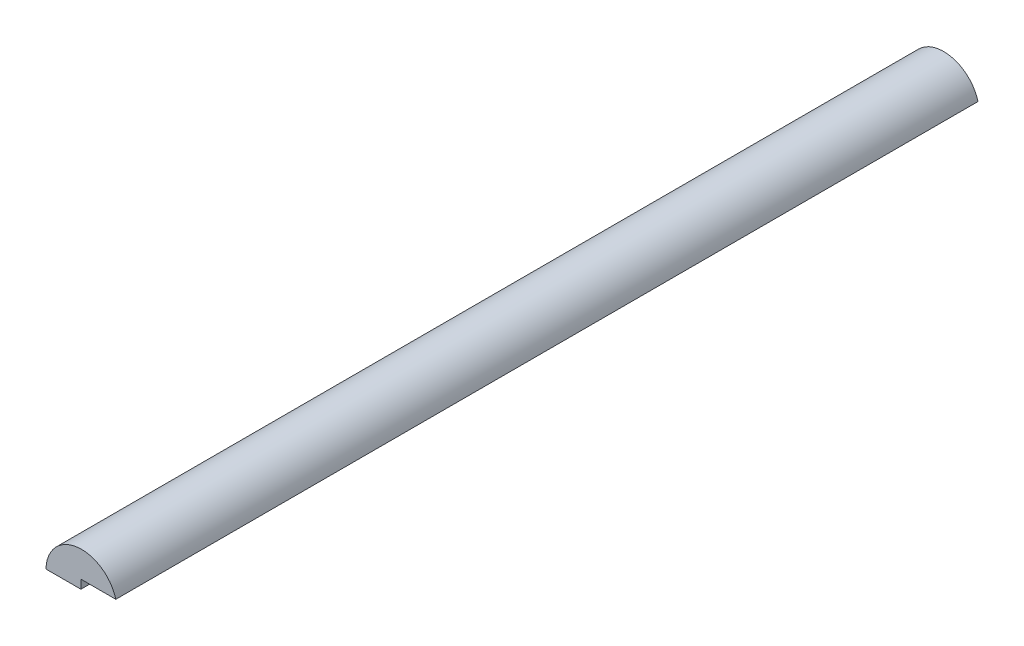
ISO-10303-21;
HEADER;
FILE_DESCRIPTION(('STEP AP214'),'2;1');
FILE_NAME('part.step','',(''),(''),'','','');
FILE_SCHEMA(('AUTOMOTIVE_DESIGN { 1 0 10303 214 1 1 1 1 }'));
ENDSEC;
DATA;
#1=APPLICATION_CONTEXT('core data for automotive mechanical design processes');
#2=APPLICATION_PROTOCOL_DEFINITION('international standard','automotive_design',2000,#1);
#3=PRODUCT_CONTEXT('',#1,'mechanical');
#4=PRODUCT('Part','Part','',(#3));
#5=PRODUCT_RELATED_PRODUCT_CATEGORY('part','',(#4));
#6=PRODUCT_DEFINITION_FORMATION('','',#4);
#7=PRODUCT_DEFINITION_CONTEXT('part definition',#1,'design');
#8=PRODUCT_DEFINITION('design','',#6,#7);
#9=PRODUCT_DEFINITION_SHAPE('','',#8);
#10=(LENGTH_UNIT() NAMED_UNIT(*) SI_UNIT(.MILLI.,.METRE.));
#11=(NAMED_UNIT(*) PLANE_ANGLE_UNIT() SI_UNIT($,.RADIAN.));
#12=(NAMED_UNIT(*) SI_UNIT($,.STERADIAN.) SOLID_ANGLE_UNIT());
#13=UNCERTAINTY_MEASURE_WITH_UNIT(LENGTH_MEASURE(1.E-05),#10,'distance_accuracy_value','');
#14=(GEOMETRIC_REPRESENTATION_CONTEXT(3) GLOBAL_UNCERTAINTY_ASSIGNED_CONTEXT((#13)) GLOBAL_UNIT_ASSIGNED_CONTEXT((#10,
#11,#12)) REPRESENTATION_CONTEXT('',''));
#15=CARTESIAN_POINT('',(0.,0.,0.));
#16=DIRECTION('',(0.,0.,1.));
#17=DIRECTION('',(1.,0.,0.));
#18=AXIS2_PLACEMENT_3D('',#15,#16,#17);
#19=CARTESIAN_POINT('',(0.,0.,12.35));
#20=DIRECTION('',(0.,1.,0.));
#21=DIRECTION('',(0.,0.,1.));
#22=AXIS2_PLACEMENT_3D('',#19,#20,#21);
#23=PLANE('',#22);
#24=DIRECTION('',(1.,0.,0.));
#25=VECTOR('',#24,1.);
#26=CARTESIAN_POINT('',(0.,0.,-12.35));
#27=LINE('',#26,#25);
#28=CARTESIAN_POINT('',(0.,0.,-12.35));
#29=VERTEX_POINT('',#28);
#30=CARTESIAN_POINT('',(1.,0.,-12.35));
#31=VERTEX_POINT('',#30);
#32=EDGE_CURVE('E96',#29,#31,#27,.T.);
#33=ORIENTED_EDGE('',*,*,#32,.T.);
#34=DIRECTION('',(0.,0.,-1.));
#35=VECTOR('',#34,1.);
#36=CARTESIAN_POINT('',(1.,0.,12.35));
#37=LINE('',#36,#35);
#38=CARTESIAN_POINT('',(1.,0.,12.35));
#39=VERTEX_POINT('',#38);
#40=EDGE_CURVE('E11',#39,#31,#37,.T.);
#41=ORIENTED_EDGE('',*,*,#40,.F.);
#42=DIRECTION('',(1.,0.,0.));
#43=VECTOR('',#42,1.);
#44=CARTESIAN_POINT('',(0.,0.,12.35));
#45=LINE('',#44,#43);
#46=CARTESIAN_POINT('',(0.,0.,12.35));
#47=VERTEX_POINT('',#46);
#48=EDGE_CURVE('E84',#47,#39,#45,.T.);
#49=ORIENTED_EDGE('',*,*,#48,.F.);
#50=DIRECTION('',(0.,0.,-1.));
#51=VECTOR('',#50,1.);
#52=CARTESIAN_POINT('',(0.,0.,12.35));
#53=LINE('',#52,#51);
#54=EDGE_CURVE('E92',#47,#29,#53,.T.);
#55=ORIENTED_EDGE('',*,*,#54,.T.);
#56=EDGE_LOOP('',(#33,#41,#49,#55));
#57=FACE_BOUND('',#56,.T.);
#58=ADVANCED_FACE('F33',(#57),#23,.F.);
#59=CARTESIAN_POINT('',(0.0178799781155297,-0.268039824924238,12.35));
#60=DIRECTION('',(0.,0.,-1.));
#61=DIRECTION('',(-1.,0.,0.));
#62=AXIS2_PLACEMENT_3D('',#59,#60,#61);
#63=CYLINDRICAL_SURFACE('',#62,1.01803982492424);
#64=CARTESIAN_POINT('',(0.0178799781155297,-0.268039824924238,-12.35));
#65=DIRECTION('',(0.,0.,1.));
#66=DIRECTION('',(1.,0.,0.));
#67=AXIS2_PLACEMENT_3D('',#64,#65,#66);
#68=CIRCLE('',#67,1.01803982492424);
#69=CARTESIAN_POINT('',(-1.,-0.25,-12.35));
#70=VERTEX_POINT('',#69);
#71=EDGE_CURVE('E88',#31,#70,#68,.T.);
#72=ORIENTED_EDGE('',*,*,#71,.T.);
#73=DIRECTION('',(0.,0.,-1.));
#74=VECTOR('',#73,1.);
#75=CARTESIAN_POINT('',(-1.,-0.25,12.35));
#76=LINE('',#75,#74);
#77=CARTESIAN_POINT('',(-1.,-0.25,12.35));
#78=VERTEX_POINT('',#77);
#79=EDGE_CURVE('E41',#78,#70,#76,.T.);
#80=ORIENTED_EDGE('',*,*,#79,.F.);
#81=CARTESIAN_POINT('',(0.0178799781155297,-0.268039824924238,12.35));
#82=DIRECTION('',(0.,0.,1.));
#83=DIRECTION('',(1.,0.,0.));
#84=AXIS2_PLACEMENT_3D('',#81,#82,#83);
#85=CIRCLE('',#84,1.01803982492424);
#86=EDGE_CURVE('E79',#39,#78,#85,.T.);
#87=ORIENTED_EDGE('',*,*,#86,.F.);
#88=ORIENTED_EDGE('',*,*,#40,.T.);
#89=EDGE_LOOP('',(#72,#80,#87,#88));
#90=FACE_BOUND('',#89,.T.);
#91=ADVANCED_FACE('F87',(#90),#63,.T.);
#92=CARTESIAN_POINT('',(0.,-0.25,12.35));
#93=DIRECTION('',(0.,1.,0.));
#94=DIRECTION('',(-1.,0.,0.));
#95=AXIS2_PLACEMENT_3D('',#92,#93,#94);
#96=PLANE('',#95);
#97=DIRECTION('',(1.,0.,0.));
#98=VECTOR('',#97,1.);
#99=CARTESIAN_POINT('',(0.,-0.25,-12.35));
#100=LINE('',#99,#98);
#101=CARTESIAN_POINT('',(0.,-0.25,-12.35));
#102=VERTEX_POINT('',#101);
#103=EDGE_CURVE('E66',#70,#102,#100,.T.);
#104=ORIENTED_EDGE('',*,*,#103,.T.);
#105=DIRECTION('',(0.,0.,-1.));
#106=VECTOR('',#105,1.);
#107=CARTESIAN_POINT('',(0.,-0.25,12.35));
#108=LINE('',#107,#106);
#109=CARTESIAN_POINT('',(0.,-0.25,12.35));
#110=VERTEX_POINT('',#109);
#111=EDGE_CURVE('E89',#110,#102,#108,.T.);
#112=ORIENTED_EDGE('',*,*,#111,.F.);
#113=DIRECTION('',(1.,0.,0.));
#114=VECTOR('',#113,1.);
#115=CARTESIAN_POINT('',(0.,-0.25,12.35));
#116=LINE('',#115,#114);
#117=EDGE_CURVE('E82',#78,#110,#116,.T.);
#118=ORIENTED_EDGE('',*,*,#117,.F.);
#119=ORIENTED_EDGE('',*,*,#79,.T.);
#120=EDGE_LOOP('',(#104,#112,#118,#119));
#121=FACE_BOUND('',#120,.T.);
#122=ADVANCED_FACE('F90',(#121),#96,.F.);
#123=CARTESIAN_POINT('',(0.,0.,12.35));
#124=DIRECTION('',(-1.,0.,0.));
#125=DIRECTION('',(0.,-1.,0.));
#126=AXIS2_PLACEMENT_3D('',#123,#124,#125);
#127=PLANE('',#126);
#128=DIRECTION('',(0.,1.,0.));
#129=VECTOR('',#128,1.);
#130=CARTESIAN_POINT('',(0.,0.,-12.35));
#131=LINE('',#130,#129);
#132=EDGE_CURVE('E72',#102,#29,#131,.T.);
#133=ORIENTED_EDGE('',*,*,#132,.T.);
#134=ORIENTED_EDGE('',*,*,#54,.F.);
#135=DIRECTION('',(0.,1.,0.));
#136=VECTOR('',#135,1.);
#137=CARTESIAN_POINT('',(0.,0.,12.35));
#138=LINE('',#137,#136);
#139=EDGE_CURVE('E49',#110,#47,#138,.T.);
#140=ORIENTED_EDGE('',*,*,#139,.F.);
#141=ORIENTED_EDGE('',*,*,#111,.T.);
#142=EDGE_LOOP('',(#133,#134,#140,#141));
#143=FACE_BOUND('',#142,.T.);
#144=ADVANCED_FACE('F103',(#143),#127,.F.);
#145=CARTESIAN_POINT('',(0.0178799781155297,-0.268039824924238,12.35));
#146=DIRECTION('',(0.,0.,1.));
#147=DIRECTION('',(1.,0.,0.));
#148=AXIS2_PLACEMENT_3D('',#145,#146,#147);
#149=PLANE('',#148);
#150=ORIENTED_EDGE('',*,*,#48,.T.);
#151=ORIENTED_EDGE('',*,*,#86,.T.);
#152=ORIENTED_EDGE('',*,*,#117,.T.);
#153=ORIENTED_EDGE('',*,*,#139,.T.);
#154=EDGE_LOOP('',(#150,#151,#152,#153));
#155=FACE_BOUND('',#154,.T.);
#156=ADVANCED_FACE('F80',(#155),#149,.T.);
#157=CARTESIAN_POINT('',(0.0178799781155297,-0.268039824924238,-12.35));
#158=DIRECTION('',(0.,0.,1.));
#159=DIRECTION('',(1.,0.,0.));
#160=AXIS2_PLACEMENT_3D('',#157,#158,#159);
#161=PLANE('',#160);
#162=ORIENTED_EDGE('',*,*,#32,.F.);
#163=ORIENTED_EDGE('',*,*,#132,.F.);
#164=ORIENTED_EDGE('',*,*,#103,.F.);
#165=ORIENTED_EDGE('',*,*,#71,.F.);
#166=EDGE_LOOP('',(#162,#163,#164,#165));
#167=FACE_BOUND('',#166,.T.);
#168=ADVANCED_FACE('F106',(#167),#161,.F.);
#169=CLOSED_SHELL('',(#58,#91,#122,#144,#156,#168));
#170=MANIFOLD_SOLID_BREP('B2',#169);
#171=ADVANCED_BREP_SHAPE_REPRESENTATION('',(#18,#170),#14);
#172=SHAPE_DEFINITION_REPRESENTATION(#9,#171);
ENDSEC;
END-ISO-10303-21;
